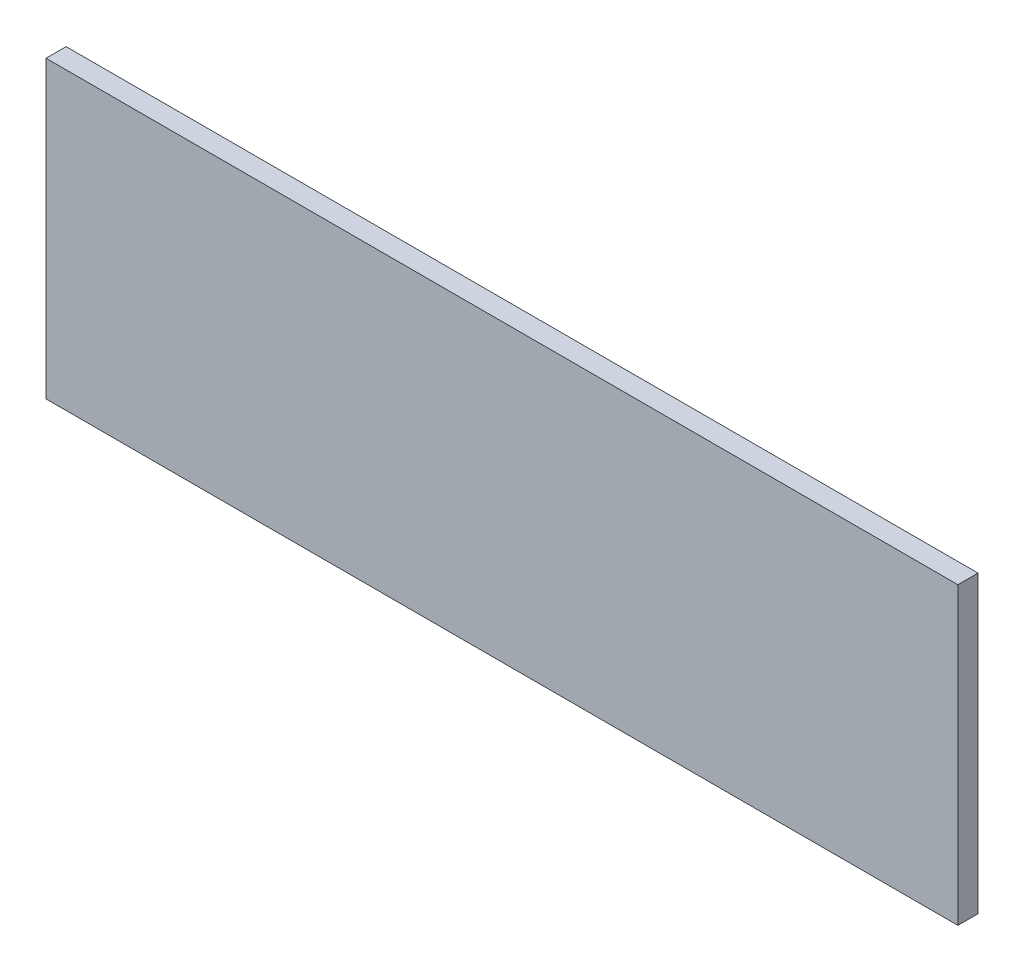
ISO-10303-21;
HEADER;
FILE_DESCRIPTION(('STEP AP214'),'2;1');
FILE_NAME('part.step','',(''),(''),'','','');
FILE_SCHEMA(('AUTOMOTIVE_DESIGN { 1 0 10303 214 1 1 1 1 }'));
ENDSEC;
DATA;
#1=APPLICATION_CONTEXT('core data for automotive mechanical design processes');
#2=APPLICATION_PROTOCOL_DEFINITION('international standard','automotive_design',2000,#1);
#3=PRODUCT_CONTEXT('',#1,'mechanical');
#4=PRODUCT('Part','Part','',(#3));
#5=PRODUCT_RELATED_PRODUCT_CATEGORY('part','',(#4));
#6=PRODUCT_DEFINITION_FORMATION('','',#4);
#7=PRODUCT_DEFINITION_CONTEXT('part definition',#1,'design');
#8=PRODUCT_DEFINITION('design','',#6,#7);
#9=PRODUCT_DEFINITION_SHAPE('','',#8);
#10=(LENGTH_UNIT() NAMED_UNIT(*) SI_UNIT(.MILLI.,.METRE.));
#11=(NAMED_UNIT(*) PLANE_ANGLE_UNIT() SI_UNIT($,.RADIAN.));
#12=(NAMED_UNIT(*) SI_UNIT($,.STERADIAN.) SOLID_ANGLE_UNIT());
#13=UNCERTAINTY_MEASURE_WITH_UNIT(LENGTH_MEASURE(1.E-05),#10,'distance_accuracy_value','');
#14=(GEOMETRIC_REPRESENTATION_CONTEXT(3) GLOBAL_UNCERTAINTY_ASSIGNED_CONTEXT((#13)) GLOBAL_UNIT_ASSIGNED_CONTEXT((#10,
#11,#12)) REPRESENTATION_CONTEXT('',''));
#15=CARTESIAN_POINT('',(0.,0.,0.));
#16=DIRECTION('',(0.,0.,1.));
#17=DIRECTION('',(1.,0.,0.));
#18=AXIS2_PLACEMENT_3D('',#15,#16,#17);
#19=CARTESIAN_POINT('',(-83.3544303797468,-0.0100000000000031,22.1518987341772));
#20=DIRECTION('',(-1.,0.,0.));
#21=DIRECTION('',(0.,0.,1.));
#22=AXIS2_PLACEMENT_3D('',#19,#20,#21);
#23=PLANE('',#22);
#24=DIRECTION('',(0.,0.,-1.));
#25=VECTOR('',#24,1.);
#26=CARTESIAN_POINT('',(-83.3544303797468,3.,0.));
#27=LINE('',#26,#25);
#28=CARTESIAN_POINT('',(-83.3544303797468,3.,22.1518987341772));
#29=VERTEX_POINT('',#28);
#30=CARTESIAN_POINT('',(-83.3544303797468,3.,19.1518987341772));
#31=VERTEX_POINT('',#30);
#32=EDGE_CURVE('E35',#29,#31,#27,.T.);
#33=ORIENTED_EDGE('',*,*,#32,.F.);
#34=DIRECTION('',(0.,1.,0.));
#35=VECTOR('',#34,1.);
#36=CARTESIAN_POINT('',(-83.3544303797468,-0.0100000000000031,22.1518987341772));
#37=LINE('',#36,#35);
#38=CARTESIAN_POINT('',(-83.3544303797468,47.,22.1518987341772));
#39=VERTEX_POINT('',#38);
#40=EDGE_CURVE('E40',#29,#39,#37,.T.);
#41=ORIENTED_EDGE('',*,*,#40,.T.);
#42=DIRECTION('',(0.,0.,1.));
#43=VECTOR('',#42,1.);
#44=CARTESIAN_POINT('',(-83.3544303797468,47.,0.));
#45=LINE('',#44,#43);
#46=CARTESIAN_POINT('',(-83.3544303797468,47.,19.1518987341772));
#47=VERTEX_POINT('',#46);
#48=EDGE_CURVE('E77',#47,#39,#45,.T.);
#49=ORIENTED_EDGE('',*,*,#48,.F.);
#50=DIRECTION('',(0.,1.,0.));
#51=VECTOR('',#50,1.);
#52=CARTESIAN_POINT('',(-83.3544303797468,-0.0100000000000031,19.1518987341772));
#53=LINE('',#52,#51);
#54=EDGE_CURVE('E74',#31,#47,#53,.T.);
#55=ORIENTED_EDGE('',*,*,#54,.F.);
#56=EDGE_LOOP('',(#33,#41,#49,#55));
#57=FACE_BOUND('',#56,.T.);
#58=ADVANCED_FACE('F32',(#57),#23,.T.);
#59=CARTESIAN_POINT('',(52.6371308016878,-0.0100000000000031,22.1518987341772));
#60=DIRECTION('',(1.,0.,0.));
#61=DIRECTION('',(0.,0.,-1.));
#62=AXIS2_PLACEMENT_3D('',#59,#60,#61);
#63=PLANE('',#62);
#64=DIRECTION('',(0.,0.,1.));
#65=VECTOR('',#64,1.);
#66=CARTESIAN_POINT('',(52.6371308016879,3.,2.43495644026E-13));
#67=LINE('',#66,#65);
#68=CARTESIAN_POINT('',(52.6371308016878,3.,19.1518987341772));
#69=VERTEX_POINT('',#68);
#70=CARTESIAN_POINT('',(52.6371308016877,3.,22.1518987341772));
#71=VERTEX_POINT('',#70);
#72=EDGE_CURVE('E81',#69,#71,#67,.T.);
#73=ORIENTED_EDGE('',*,*,#72,.F.);
#74=DIRECTION('',(0.,1.,0.));
#75=VECTOR('',#74,1.);
#76=CARTESIAN_POINT('',(52.6371308016878,-0.0100000000000031,19.1518987341772));
#77=LINE('',#76,#75);
#78=CARTESIAN_POINT('',(52.6371308016878,47.,19.1518987341772));
#79=VERTEX_POINT('',#78);
#80=EDGE_CURVE('E94',#69,#79,#77,.T.);
#81=ORIENTED_EDGE('',*,*,#80,.T.);
#82=DIRECTION('',(0.,0.,-1.));
#83=VECTOR('',#82,1.);
#84=CARTESIAN_POINT('',(52.6371308016879,47.,2.43495644026E-13));
#85=LINE('',#84,#83);
#86=CARTESIAN_POINT('',(52.6371308016877,47.,22.1518987341772));
#87=VERTEX_POINT('',#86);
#88=EDGE_CURVE('E90',#87,#79,#85,.T.);
#89=ORIENTED_EDGE('',*,*,#88,.F.);
#90=DIRECTION('',(0.,-1.,0.));
#91=VECTOR('',#90,1.);
#92=CARTESIAN_POINT('',(52.6371308016877,50.,22.1518987341772));
#93=LINE('',#92,#91);
#94=EDGE_CURVE('E11',#87,#71,#93,.T.);
#95=ORIENTED_EDGE('',*,*,#94,.T.);
#96=EDGE_LOOP('',(#73,#81,#89,#95));
#97=FACE_BOUND('',#96,.T.);
#98=ADVANCED_FACE('F104',(#97),#63,.T.);
#99=CARTESIAN_POINT('',(-98.3544303797468,50.,22.1518987341772));
#100=DIRECTION('',(0.,0.,-1.));
#101=DIRECTION('',(-1.,0.,0.));
#102=AXIS2_PLACEMENT_3D('',#99,#100,#101);
#103=PLANE('',#102);
#104=ORIENTED_EDGE('',*,*,#40,.F.);
#105=DIRECTION('',(-1.,0.,0.));
#106=VECTOR('',#105,1.);
#107=CARTESIAN_POINT('',(-98.3544303797468,3.,22.1518987341772));
#108=LINE('',#107,#106);
#109=EDGE_CURVE('E89',#71,#29,#108,.T.);
#110=ORIENTED_EDGE('',*,*,#109,.F.);
#111=ORIENTED_EDGE('',*,*,#94,.F.);
#112=DIRECTION('',(1.,0.,0.));
#113=VECTOR('',#112,1.);
#114=CARTESIAN_POINT('',(-98.3544303797468,47.,22.1518987341772));
#115=LINE('',#114,#113);
#116=EDGE_CURVE('E48',#39,#87,#115,.T.);
#117=ORIENTED_EDGE('',*,*,#116,.F.);
#118=EDGE_LOOP('',(#104,#110,#111,#117));
#119=FACE_BOUND('',#118,.T.);
#120=ADVANCED_FACE('F105',(#119),#103,.F.);
#121=CARTESIAN_POINT('',(0.,47.,0.));
#122=DIRECTION('',(0.,1.,0.));
#123=DIRECTION('',(0.,0.,1.));
#124=AXIS2_PLACEMENT_3D('',#121,#122,#123);
#125=PLANE('',#124);
#126=DIRECTION('',(1.,0.,0.));
#127=VECTOR('',#126,1.);
#128=CARTESIAN_POINT('',(-98.3544303797468,47.,19.1518987341772));
#129=LINE('',#128,#127);
#130=EDGE_CURVE('E82',#47,#79,#129,.T.);
#131=ORIENTED_EDGE('',*,*,#130,.F.);
#132=ORIENTED_EDGE('',*,*,#48,.T.);
#133=ORIENTED_EDGE('',*,*,#116,.T.);
#134=ORIENTED_EDGE('',*,*,#88,.T.);
#135=EDGE_LOOP('',(#131,#132,#133,#134));
#136=FACE_BOUND('',#135,.T.);
#137=ADVANCED_FACE('F107',(#136),#125,.T.);
#138=CARTESIAN_POINT('',(0.,3.,0.));
#139=DIRECTION('',(0.,-1.,0.));
#140=DIRECTION('',(0.,0.,-1.));
#141=AXIS2_PLACEMENT_3D('',#138,#139,#140);
#142=PLANE('',#141);
#143=ORIENTED_EDGE('',*,*,#109,.T.);
#144=ORIENTED_EDGE('',*,*,#32,.T.);
#145=DIRECTION('',(1.,0.,0.));
#146=VECTOR('',#145,1.);
#147=CARTESIAN_POINT('',(-98.3544303797468,3.,19.1518987341772));
#148=LINE('',#147,#146);
#149=EDGE_CURVE('E87',#31,#69,#148,.T.);
#150=ORIENTED_EDGE('',*,*,#149,.T.);
#151=ORIENTED_EDGE('',*,*,#72,.T.);
#152=EDGE_LOOP('',(#143,#144,#150,#151));
#153=FACE_BOUND('',#152,.T.);
#154=ADVANCED_FACE('F85',(#153),#142,.T.);
#155=CARTESIAN_POINT('',(-98.3544303797468,47.,19.1518987341772));
#156=DIRECTION('',(0.,0.,-1.));
#157=DIRECTION('',(-1.,0.,0.));
#158=AXIS2_PLACEMENT_3D('',#155,#156,#157);
#159=PLANE('',#158);
#160=ORIENTED_EDGE('',*,*,#149,.F.);
#161=ORIENTED_EDGE('',*,*,#54,.T.);
#162=ORIENTED_EDGE('',*,*,#130,.T.);
#163=ORIENTED_EDGE('',*,*,#80,.F.);
#164=EDGE_LOOP('',(#160,#161,#162,#163));
#165=FACE_BOUND('',#164,.T.);
#166=ADVANCED_FACE('F92',(#165),#159,.T.);
#167=CLOSED_SHELL('',(#58,#98,#120,#137,#154,#166));
#168=MANIFOLD_SOLID_BREP('B2',#167);
#169=ADVANCED_BREP_SHAPE_REPRESENTATION('',(#18,#168),#14);
#170=SHAPE_DEFINITION_REPRESENTATION(#9,#169);
ENDSEC;
END-ISO-10303-21;
